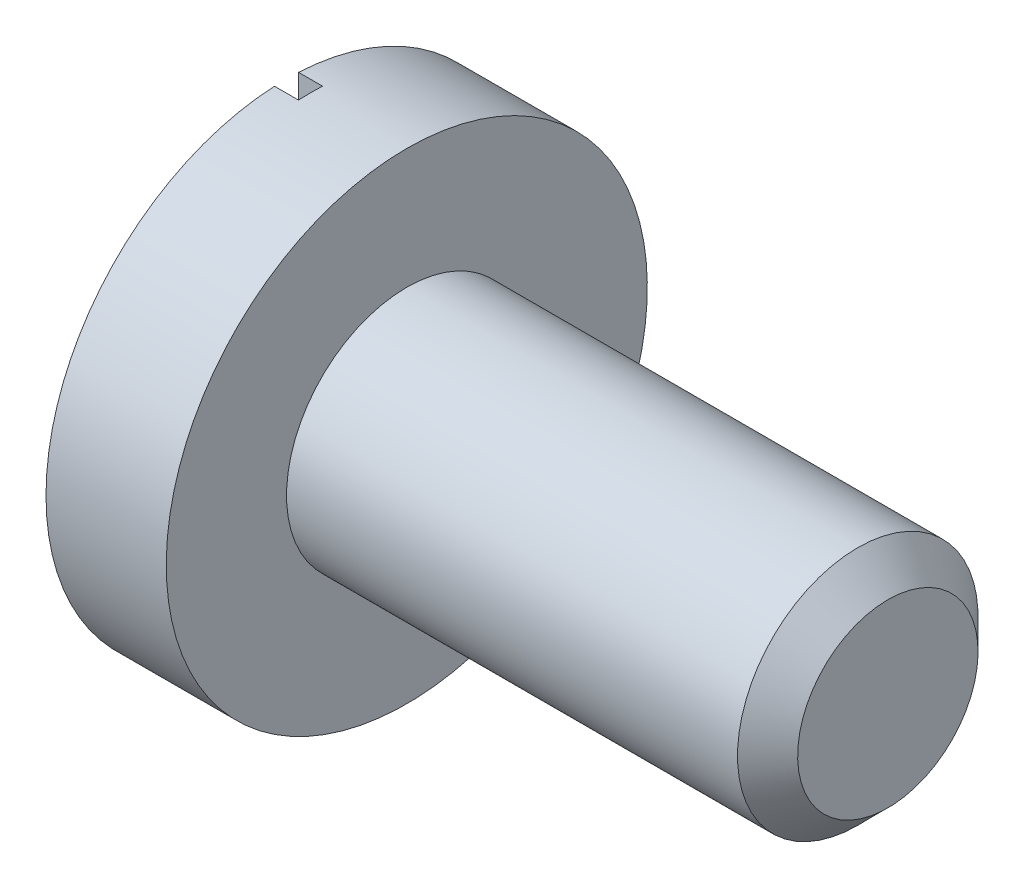
ISO-10303-21;
HEADER;
FILE_DESCRIPTION(('STEP AP214'),'2;1');
FILE_NAME('part.step','',(''),(''),'','','');
FILE_SCHEMA(('AUTOMOTIVE_DESIGN { 1 0 10303 214 1 1 1 1 }'));
ENDSEC;
DATA;
#1=APPLICATION_CONTEXT('core data for automotive mechanical design processes');
#2=APPLICATION_PROTOCOL_DEFINITION('international standard','automotive_design',2000,#1);
#3=PRODUCT_CONTEXT('',#1,'mechanical');
#4=PRODUCT('Part','Part','',(#3));
#5=PRODUCT_RELATED_PRODUCT_CATEGORY('part','',(#4));
#6=PRODUCT_DEFINITION_FORMATION('','',#4);
#7=PRODUCT_DEFINITION_CONTEXT('part definition',#1,'design');
#8=PRODUCT_DEFINITION('design','',#6,#7);
#9=PRODUCT_DEFINITION_SHAPE('','',#8);
#10=(LENGTH_UNIT() NAMED_UNIT(*) SI_UNIT(.MILLI.,.METRE.));
#11=(NAMED_UNIT(*) PLANE_ANGLE_UNIT() SI_UNIT($,.RADIAN.));
#12=(NAMED_UNIT(*) SI_UNIT($,.STERADIAN.) SOLID_ANGLE_UNIT());
#13=UNCERTAINTY_MEASURE_WITH_UNIT(LENGTH_MEASURE(1.E-05),#10,'distance_accuracy_value','');
#14=(GEOMETRIC_REPRESENTATION_CONTEXT(3) GLOBAL_UNCERTAINTY_ASSIGNED_CONTEXT((#13)) GLOBAL_UNIT_ASSIGNED_CONTEXT((#10,
#11,#12)) REPRESENTATION_CONTEXT('',''));
#15=CARTESIAN_POINT('',(0.,0.,0.));
#16=DIRECTION('',(0.,0.,1.));
#17=DIRECTION('',(1.,0.,0.));
#18=AXIS2_PLACEMENT_3D('',#15,#16,#17);
#19=CARTESIAN_POINT('',(0.,0.,0.));
#20=DIRECTION('',(-1.,0.,0.));
#21=DIRECTION('',(0.,-1.,0.));
#22=AXIS2_PLACEMENT_3D('',#19,#20,#21);
#23=PLANE('',#22);
#24=DIRECTION('',(0.,-1.,0.));
#25=VECTOR('',#24,1.);
#26=CARTESIAN_POINT('',(0.,0.998749217771909,-0.0500000000000003));
#27=LINE('',#26,#25);
#28=CARTESIAN_POINT('',(0.,0.998749217771909,-0.0500000000000001));
#29=VERTEX_POINT('',#28);
#30=CARTESIAN_POINT('',(0.,-0.998749217771909,-0.0499999999999998));
#31=VERTEX_POINT('',#30);
#32=EDGE_CURVE('E75',#29,#31,#27,.T.);
#33=ORIENTED_EDGE('',*,*,#32,.F.);
#34=CARTESIAN_POINT('',(0.,0.,0.));
#35=DIRECTION('',(1.,0.,0.));
#36=DIRECTION('',(0.,1.,0.));
#37=AXIS2_PLACEMENT_3D('',#34,#35,#36);
#38=CIRCLE('',#37,1.);
#39=EDGE_CURVE('E111',#31,#29,#38,.T.);
#40=ORIENTED_EDGE('',*,*,#39,.F.);
#41=EDGE_LOOP('',(#33,#40));
#42=FACE_BOUND('',#41,.T.);
#43=ADVANCED_FACE('F36',(#42),#23,.T.);
#44=DIRECTION('',(0.,1.,0.));
#45=VECTOR('',#44,1.);
#46=CARTESIAN_POINT('',(0.,0.998749217771909,0.0500000000000002));
#47=LINE('',#46,#45);
#48=CARTESIAN_POINT('',(0.,-0.998749217771909,0.0500000000000002));
#49=VERTEX_POINT('',#48);
#50=CARTESIAN_POINT('',(0.,0.998749217771909,0.0500000000000002));
#51=VERTEX_POINT('',#50);
#52=EDGE_CURVE('E230',#49,#51,#47,.T.);
#53=ORIENTED_EDGE('',*,*,#52,.F.);
#54=EDGE_CURVE('E97',#51,#49,#38,.T.);
#55=ORIENTED_EDGE('',*,*,#54,.F.);
#56=EDGE_LOOP('',(#53,#55));
#57=FACE_BOUND('',#56,.T.);
#58=ADVANCED_FACE('F129',(#57),#23,.T.);
#59=CARTESIAN_POINT('',(2.5,0.,0.));
#60=DIRECTION('',(1.,0.,0.));
#61=DIRECTION('',(0.,1.,0.));
#62=AXIS2_PLACEMENT_3D('',#59,#60,#61);
#63=CYLINDRICAL_SURFACE('',#62,1.);
#64=DIRECTION('',(-1.,0.,0.));
#65=VECTOR('',#64,1.);
#66=CARTESIAN_POINT('',(0.1,0.998749217771909,-0.0500000000000001));
#67=LINE('',#66,#65);
#68=CARTESIAN_POINT('',(0.1,0.998749217771909,-0.0500000000000001));
#69=VERTEX_POINT('',#68);
#70=EDGE_CURVE('E99',#69,#29,#67,.T.);
#71=ORIENTED_EDGE('',*,*,#70,.F.);
#72=CARTESIAN_POINT('',(0.1,0.,0.));
#73=DIRECTION('',(-1.,0.,0.));
#74=DIRECTION('',(0.,-1.,0.));
#75=AXIS2_PLACEMENT_3D('',#72,#73,#74);
#76=CIRCLE('',#75,1.);
#77=CARTESIAN_POINT('',(0.1,0.998749217771909,0.0500000000000002));
#78=VERTEX_POINT('',#77);
#79=EDGE_CURVE('E57',#78,#69,#76,.T.);
#80=ORIENTED_EDGE('',*,*,#79,.F.);
#81=DIRECTION('',(-1.,0.,0.));
#82=VECTOR('',#81,1.);
#83=CARTESIAN_POINT('',(0.1,0.998749217771909,0.0500000000000002));
#84=LINE('',#83,#82);
#85=EDGE_CURVE('E85',#78,#51,#84,.T.);
#86=ORIENTED_EDGE('',*,*,#85,.T.);
#87=ORIENTED_EDGE('',*,*,#54,.T.);
#88=DIRECTION('',(-1.,0.,0.));
#89=VECTOR('',#88,1.);
#90=CARTESIAN_POINT('',(0.1,-0.998749217771909,0.0500000000000002));
#91=LINE('',#90,#89);
#92=CARTESIAN_POINT('',(0.1,-0.998749217771909,0.0500000000000002));
#93=VERTEX_POINT('',#92);
#94=EDGE_CURVE('E82',#93,#49,#91,.T.);
#95=ORIENTED_EDGE('',*,*,#94,.F.);
#96=CARTESIAN_POINT('',(0.1,0.,0.));
#97=DIRECTION('',(-1.,0.,0.));
#98=DIRECTION('',(0.,-1.,0.));
#99=AXIS2_PLACEMENT_3D('',#96,#97,#98);
#100=CIRCLE('',#99,1.);
#101=CARTESIAN_POINT('',(0.0999999999999999,-0.998749217771909,-0.0499999999999998));
#102=VERTEX_POINT('',#101);
#103=EDGE_CURVE('E86',#102,#93,#100,.T.);
#104=ORIENTED_EDGE('',*,*,#103,.F.);
#105=DIRECTION('',(-1.,0.,0.));
#106=VECTOR('',#105,1.);
#107=CARTESIAN_POINT('',(0.1,-0.998749217771909,-0.0499999999999998));
#108=LINE('',#107,#106);
#109=EDGE_CURVE('E108',#102,#31,#108,.T.);
#110=ORIENTED_EDGE('',*,*,#109,.T.);
#111=ORIENTED_EDGE('',*,*,#39,.T.);
#112=EDGE_LOOP('',(#71,#80,#86,#87,#95,#104,#110,#111));
#113=FACE_BOUND('',#112,.T.);
#114=CARTESIAN_POINT('',(0.5,0.,0.));
#115=DIRECTION('',(1.,0.,0.));
#116=DIRECTION('',(0.,1.,0.));
#117=AXIS2_PLACEMENT_3D('',#114,#115,#116);
#118=CIRCLE('',#117,1.);
#119=CARTESIAN_POINT('',(0.5,1.,0.));
#120=VERTEX_POINT('',#119);
#121=EDGE_CURVE('E107',#120,#120,#118,.T.);
#122=ORIENTED_EDGE('',*,*,#121,.F.);
#123=EDGE_LOOP('',(#122));
#124=FACE_BOUND('',#123,.T.);
#125=ADVANCED_FACE('F94',(#113,#124),#63,.T.);
#126=CARTESIAN_POINT('',(0.5,1.,0.));
#127=DIRECTION('',(1.,0.,0.));
#128=DIRECTION('',(0.,1.,0.));
#129=AXIS2_PLACEMENT_3D('',#126,#127,#128);
#130=PLANE('',#129);
#131=ORIENTED_EDGE('',*,*,#121,.T.);
#132=EDGE_LOOP('',(#131));
#133=FACE_BOUND('',#132,.T.);
#134=CARTESIAN_POINT('',(0.5,0.,0.));
#135=DIRECTION('',(1.,0.,0.));
#136=DIRECTION('',(0.,1.,0.));
#137=AXIS2_PLACEMENT_3D('',#134,#135,#136);
#138=CIRCLE('',#137,0.5);
#139=CARTESIAN_POINT('',(0.5,0.5,0.));
#140=VERTEX_POINT('',#139);
#141=EDGE_CURVE('E104',#140,#140,#138,.T.);
#142=ORIENTED_EDGE('',*,*,#141,.F.);
#143=EDGE_LOOP('',(#142));
#144=FACE_BOUND('',#143,.T.);
#145=ADVANCED_FACE('F138',(#133,#144),#130,.T.);
#146=CARTESIAN_POINT('',(2.5,0.,0.));
#147=DIRECTION('',(1.,0.,0.));
#148=DIRECTION('',(0.,1.,0.));
#149=AXIS2_PLACEMENT_3D('',#146,#147,#148);
#150=CYLINDRICAL_SURFACE('',#149,0.5);
#151=CARTESIAN_POINT('',(2.375,0.,0.));
#152=DIRECTION('',(1.,0.,0.));
#153=DIRECTION('',(0.,1.,0.));
#154=AXIS2_PLACEMENT_3D('',#151,#152,#153);
#155=CIRCLE('',#154,0.5);
#156=CARTESIAN_POINT('',(2.375,0.5,0.));
#157=VERTEX_POINT('',#156);
#158=EDGE_CURVE('E11',#157,#157,#155,.F.);
#159=ORIENTED_EDGE('',*,*,#158,.T.);
#160=EDGE_LOOP('',(#159));
#161=FACE_BOUND('',#160,.T.);
#162=ORIENTED_EDGE('',*,*,#141,.T.);
#163=EDGE_LOOP('',(#162));
#164=FACE_BOUND('',#163,.T.);
#165=ADVANCED_FACE('F125',(#161,#164),#150,.T.);
#166=CARTESIAN_POINT('',(2.5,0.5,0.));
#167=DIRECTION('',(1.,0.,0.));
#168=DIRECTION('',(0.,1.,0.));
#169=AXIS2_PLACEMENT_3D('',#166,#167,#168);
#170=PLANE('',#169);
#171=CARTESIAN_POINT('',(2.5,0.,0.));
#172=DIRECTION('',(1.,0.,0.));
#173=DIRECTION('',(0.,1.,0.));
#174=AXIS2_PLACEMENT_3D('',#171,#172,#173);
#175=CIRCLE('',#174,0.374999999999999);
#176=CARTESIAN_POINT('',(2.5,0.374999999999999,0.));
#177=VERTEX_POINT('',#176);
#178=EDGE_CURVE('E44',#177,#177,#175,.T.);
#179=ORIENTED_EDGE('',*,*,#178,.T.);
#180=EDGE_LOOP('',(#179));
#181=FACE_BOUND('',#180,.T.);
#182=ADVANCED_FACE('F115',(#181),#170,.T.);
#183=CARTESIAN_POINT('',(2.5,0.,0.));
#184=DIRECTION('',(-1.,0.,0.));
#185=DIRECTION('',(0.,-1.,0.));
#186=AXIS2_PLACEMENT_3D('',#183,#184,#185);
#187=CONICAL_SURFACE('',#186,0.374999999999999,0.785398163397444);
#188=ORIENTED_EDGE('',*,*,#158,.F.);
#189=EDGE_LOOP('',(#188));
#190=FACE_BOUND('',#189,.T.);
#191=ORIENTED_EDGE('',*,*,#178,.F.);
#192=EDGE_LOOP('',(#191));
#193=FACE_BOUND('',#192,.T.);
#194=ADVANCED_FACE('F38',(#190,#193),#187,.T.);
#195=CARTESIAN_POINT('',(0.1,0.998749217771909,-0.0500000000000003));
#196=DIRECTION('',(0.,0.,-1.));
#197=DIRECTION('',(0.,1.,0.));
#198=AXIS2_PLACEMENT_3D('',#195,#196,#197);
#199=PLANE('',#198);
#200=ORIENTED_EDGE('',*,*,#32,.T.);
#201=ORIENTED_EDGE('',*,*,#109,.F.);
#202=DIRECTION('',(0.,-1.,0.));
#203=VECTOR('',#202,1.);
#204=CARTESIAN_POINT('',(0.1,0.998749217771909,-0.0500000000000003));
#205=LINE('',#204,#203);
#206=EDGE_CURVE('E51',#69,#102,#205,.T.);
#207=ORIENTED_EDGE('',*,*,#206,.F.);
#208=ORIENTED_EDGE('',*,*,#70,.T.);
#209=EDGE_LOOP('',(#200,#201,#207,#208));
#210=FACE_BOUND('',#209,.T.);
#211=ADVANCED_FACE('F118',(#210),#199,.F.);
#212=CARTESIAN_POINT('',(0.1,0.998749217771909,0.0500000000000002));
#213=DIRECTION('',(0.,0.,1.));
#214=DIRECTION('',(1.,0.,0.));
#215=AXIS2_PLACEMENT_3D('',#212,#213,#214);
#216=PLANE('',#215);
#217=ORIENTED_EDGE('',*,*,#52,.T.);
#218=ORIENTED_EDGE('',*,*,#85,.F.);
#219=DIRECTION('',(0.,1.,0.));
#220=VECTOR('',#219,1.);
#221=CARTESIAN_POINT('',(0.1,0.998749217771909,0.0500000000000002));
#222=LINE('',#221,#220);
#223=EDGE_CURVE('E79',#93,#78,#222,.T.);
#224=ORIENTED_EDGE('',*,*,#223,.F.);
#225=ORIENTED_EDGE('',*,*,#94,.T.);
#226=EDGE_LOOP('',(#217,#218,#224,#225));
#227=FACE_BOUND('',#226,.T.);
#228=ADVANCED_FACE('F80',(#227),#216,.F.);
#229=CARTESIAN_POINT('',(0.1,0.,0.));
#230=DIRECTION('',(-1.,0.,0.));
#231=DIRECTION('',(0.,-1.,0.));
#232=AXIS2_PLACEMENT_3D('',#229,#230,#231);
#233=PLANE('',#232);
#234=ORIENTED_EDGE('',*,*,#103,.T.);
#235=ORIENTED_EDGE('',*,*,#223,.T.);
#236=ORIENTED_EDGE('',*,*,#79,.T.);
#237=ORIENTED_EDGE('',*,*,#206,.T.);
#238=EDGE_LOOP('',(#234,#235,#236,#237));
#239=FACE_BOUND('',#238,.T.);
#240=ADVANCED_FACE('F89',(#239),#233,.T.);
#241=CLOSED_SHELL('',(#43,#58,#125,#145,#165,#182,#194,#211,#228,#240));
#242=MANIFOLD_SOLID_BREP('B2',#241);
#243=ADVANCED_BREP_SHAPE_REPRESENTATION('',(#18,#242),#14);
#244=SHAPE_DEFINITION_REPRESENTATION(#9,#243);
ENDSEC;
END-ISO-10303-21;
